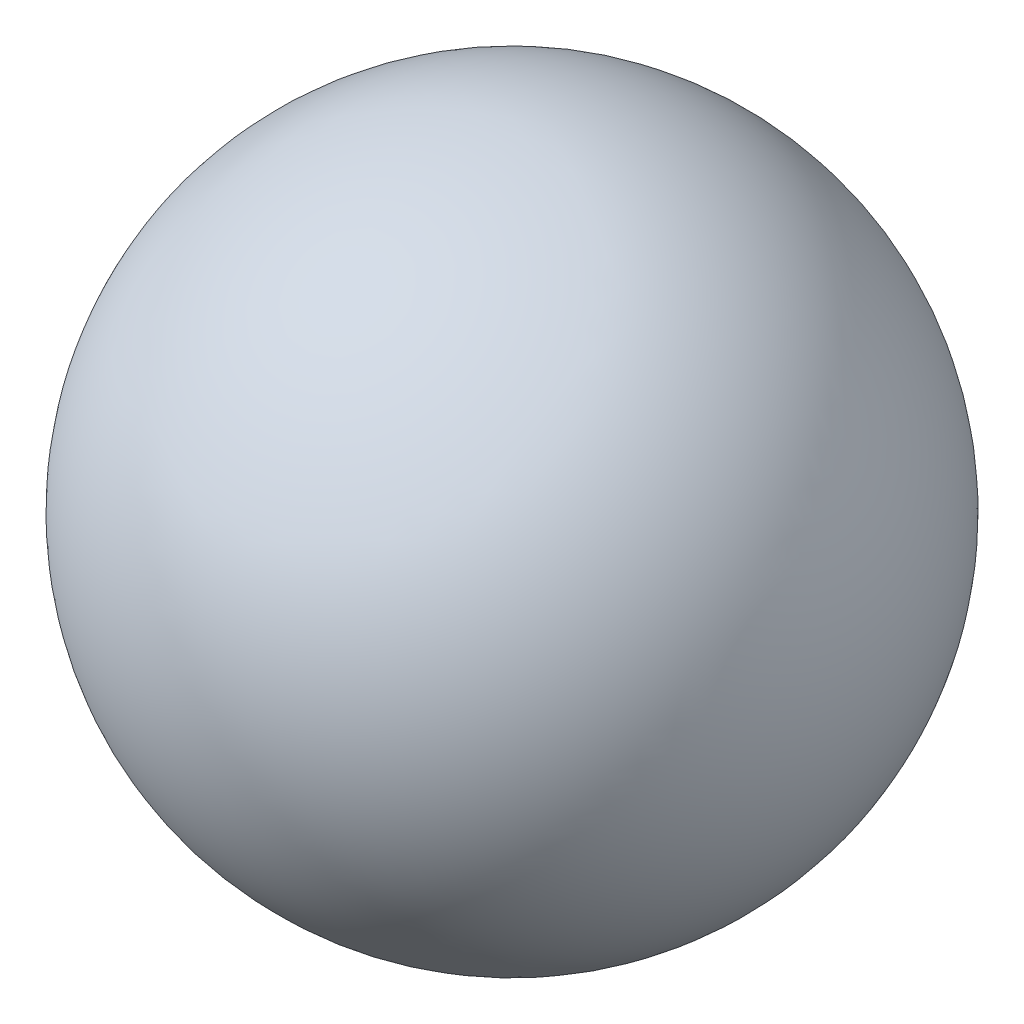
ISO-10303-21;
HEADER;
FILE_DESCRIPTION(('STEP AP214'),'2;1');
FILE_NAME('part.step','',(''),(''),'','','');
FILE_SCHEMA(('AUTOMOTIVE_DESIGN { 1 0 10303 214 1 1 1 1 }'));
ENDSEC;
DATA;
#1=APPLICATION_CONTEXT('core data for automotive mechanical design processes');
#2=APPLICATION_PROTOCOL_DEFINITION('international standard','automotive_design',2000,#1);
#3=PRODUCT_CONTEXT('',#1,'mechanical');
#4=PRODUCT('Part','Part','',(#3));
#5=PRODUCT_RELATED_PRODUCT_CATEGORY('part','',(#4));
#6=PRODUCT_DEFINITION_FORMATION('','',#4);
#7=PRODUCT_DEFINITION_CONTEXT('part definition',#1,'design');
#8=PRODUCT_DEFINITION('design','',#6,#7);
#9=PRODUCT_DEFINITION_SHAPE('','',#8);
#10=(LENGTH_UNIT() NAMED_UNIT(*) SI_UNIT(.MILLI.,.METRE.));
#11=(NAMED_UNIT(*) PLANE_ANGLE_UNIT() SI_UNIT($,.RADIAN.));
#12=(NAMED_UNIT(*) SI_UNIT($,.STERADIAN.) SOLID_ANGLE_UNIT());
#13=UNCERTAINTY_MEASURE_WITH_UNIT(LENGTH_MEASURE(1.E-05),#10,'distance_accuracy_value','');
#14=(GEOMETRIC_REPRESENTATION_CONTEXT(3) GLOBAL_UNCERTAINTY_ASSIGNED_CONTEXT((#13)) GLOBAL_UNIT_ASSIGNED_CONTEXT((#10,
#11,#12)) REPRESENTATION_CONTEXT('',''));
#15=CARTESIAN_POINT('',(0.,0.,0.));
#16=DIRECTION('',(0.,0.,1.));
#17=DIRECTION('',(1.,0.,0.));
#18=AXIS2_PLACEMENT_3D('',#15,#16,#17);
#19=CARTESIAN_POINT('',(0.,0.,0.));
#20=DIRECTION('',(-1.,0.,0.));
#21=DIRECTION('',(0.,0.,-1.));
#22=AXIS2_PLACEMENT_3D('',#19,#20,#21);
#23=SPHERICAL_SURFACE('',#22,50.8);
#24=CARTESIAN_POINT('',(-50.8,0.,0.));
#25=VERTEX_POINT('',#24);
#26=VERTEX_LOOP('',#25);
#27=FACE_BOUND('',#26,.T.);
#28=ADVANCED_FACE('F29',(#27),#23,.T.);
#29=CLOSED_SHELL('',(#28));
#30=MANIFOLD_SOLID_BREP('B2',#29);
#31=ADVANCED_BREP_SHAPE_REPRESENTATION('',(#18,#30),#14);
#32=SHAPE_DEFINITION_REPRESENTATION(#9,#31);
ENDSEC;
END-ISO-10303-21;
